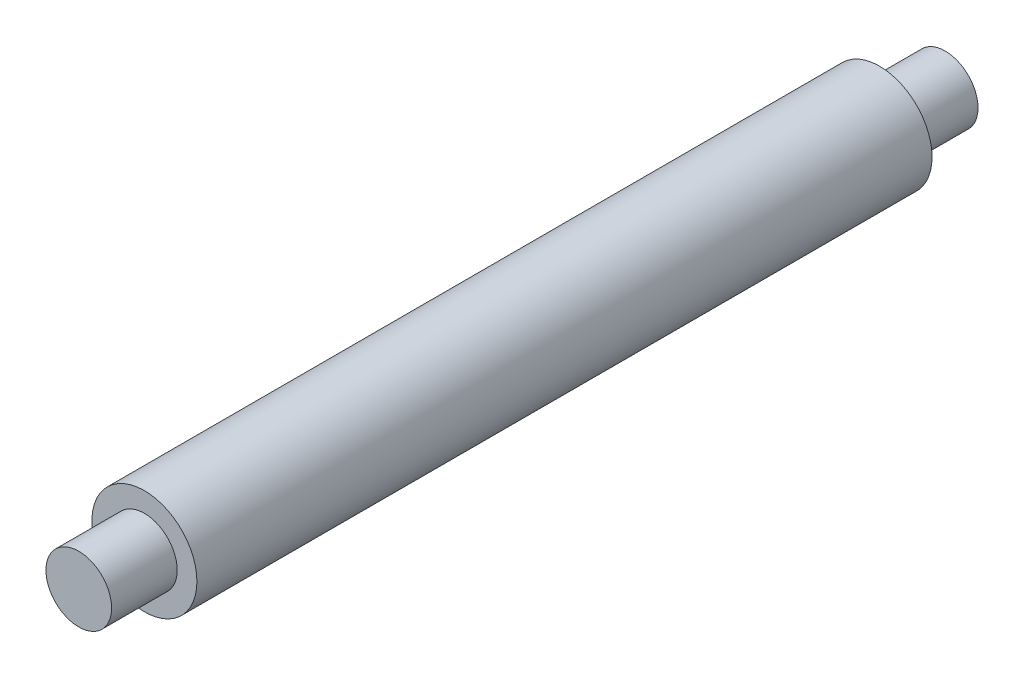
ISO-10303-21;
HEADER;
FILE_DESCRIPTION(('STEP AP214'),'2;1');
FILE_NAME('part.step','',(''),(''),'','','');
FILE_SCHEMA(('AUTOMOTIVE_DESIGN { 1 0 10303 214 1 1 1 1 }'));
ENDSEC;
DATA;
#1=APPLICATION_CONTEXT('core data for automotive mechanical design processes');
#2=APPLICATION_PROTOCOL_DEFINITION('international standard','automotive_design',2000,#1);
#3=PRODUCT_CONTEXT('',#1,'mechanical');
#4=PRODUCT('Part','Part','',(#3));
#5=PRODUCT_RELATED_PRODUCT_CATEGORY('part','',(#4));
#6=PRODUCT_DEFINITION_FORMATION('','',#4);
#7=PRODUCT_DEFINITION_CONTEXT('part definition',#1,'design');
#8=PRODUCT_DEFINITION('design','',#6,#7);
#9=PRODUCT_DEFINITION_SHAPE('','',#8);
#10=(LENGTH_UNIT() NAMED_UNIT(*) SI_UNIT(.MILLI.,.METRE.));
#11=(NAMED_UNIT(*) PLANE_ANGLE_UNIT() SI_UNIT($,.RADIAN.));
#12=(NAMED_UNIT(*) SI_UNIT($,.STERADIAN.) SOLID_ANGLE_UNIT());
#13=UNCERTAINTY_MEASURE_WITH_UNIT(LENGTH_MEASURE(1.E-05),#10,'distance_accuracy_value','');
#14=(GEOMETRIC_REPRESENTATION_CONTEXT(3) GLOBAL_UNCERTAINTY_ASSIGNED_CONTEXT((#13)) GLOBAL_UNIT_ASSIGNED_CONTEXT((#10,
#11,#12)) REPRESENTATION_CONTEXT('',''));
#15=CARTESIAN_POINT('',(0.,0.,0.));
#16=DIRECTION('',(0.,0.,1.));
#17=DIRECTION('',(1.,0.,0.));
#18=AXIS2_PLACEMENT_3D('',#15,#16,#17);
#19=CARTESIAN_POINT('',(0.,0.,56.));
#20=DIRECTION('',(0.,0.,-1.));
#21=DIRECTION('',(-1.,0.,0.));
#22=AXIS2_PLACEMENT_3D('',#19,#20,#21);
#23=CYLINDRICAL_SURFACE('',#22,4.);
#24=CARTESIAN_POINT('',(0.,0.,56.));
#25=DIRECTION('',(0.,0.,1.));
#26=DIRECTION('',(1.,0.,0.));
#27=AXIS2_PLACEMENT_3D('',#24,#25,#26);
#28=CIRCLE('',#27,4.);
#29=CARTESIAN_POINT('',(4.,0.,56.));
#30=VERTEX_POINT('',#29);
#31=EDGE_CURVE('E36',#30,#30,#28,.T.);
#32=ORIENTED_EDGE('',*,*,#31,.F.);
#33=EDGE_LOOP('',(#32));
#34=FACE_BOUND('',#33,.T.);
#35=CARTESIAN_POINT('',(0.,0.,0.));
#36=DIRECTION('',(0.,0.,1.));
#37=DIRECTION('',(1.,0.,0.));
#38=AXIS2_PLACEMENT_3D('',#35,#36,#37);
#39=CIRCLE('',#38,4.);
#40=CARTESIAN_POINT('',(4.,0.,0.));
#41=VERTEX_POINT('',#40);
#42=EDGE_CURVE('E40',#41,#41,#39,.T.);
#43=ORIENTED_EDGE('',*,*,#42,.T.);
#44=EDGE_LOOP('',(#43));
#45=FACE_BOUND('',#44,.T.);
#46=ADVANCED_FACE('F30',(#34,#45),#23,.T.);
#47=CARTESIAN_POINT('',(0.,0.,56.));
#48=DIRECTION('',(0.,0.,1.));
#49=DIRECTION('',(1.,0.,0.));
#50=AXIS2_PLACEMENT_3D('',#47,#48,#49);
#51=PLANE('',#50);
#52=CARTESIAN_POINT('',(0.,0.,56.));
#53=DIRECTION('',(0.,0.,1.));
#54=DIRECTION('',(1.,0.,0.));
#55=AXIS2_PLACEMENT_3D('',#52,#53,#54);
#56=CIRCLE('',#55,2.5);
#57=CARTESIAN_POINT('',(2.5,0.,56.));
#58=VERTEX_POINT('',#57);
#59=EDGE_CURVE('E47',#58,#58,#56,.T.);
#60=ORIENTED_EDGE('',*,*,#59,.F.);
#61=EDGE_LOOP('',(#60));
#62=FACE_BOUND('',#61,.T.);
#63=ORIENTED_EDGE('',*,*,#31,.T.);
#64=EDGE_LOOP('',(#63));
#65=FACE_BOUND('',#64,.T.);
#66=ADVANCED_FACE('F71',(#62,#65),#51,.T.);
#67=CARTESIAN_POINT('',(0.,0.,0.));
#68=DIRECTION('',(0.,0.,1.));
#69=DIRECTION('',(1.,0.,0.));
#70=AXIS2_PLACEMENT_3D('',#67,#68,#69);
#71=PLANE('',#70);
#72=CARTESIAN_POINT('',(0.,0.,0.));
#73=DIRECTION('',(0.,0.,1.));
#74=DIRECTION('',(1.,0.,0.));
#75=AXIS2_PLACEMENT_3D('',#72,#73,#74);
#76=CIRCLE('',#75,2.5);
#77=CARTESIAN_POINT('',(2.5,0.,0.));
#78=VERTEX_POINT('',#77);
#79=EDGE_CURVE('E10',#78,#78,#76,.F.);
#80=ORIENTED_EDGE('',*,*,#79,.F.);
#81=EDGE_LOOP('',(#80));
#82=FACE_BOUND('',#81,.T.);
#83=ORIENTED_EDGE('',*,*,#42,.F.);
#84=EDGE_LOOP('',(#83));
#85=FACE_BOUND('',#84,.T.);
#86=ADVANCED_FACE('F76',(#82,#85),#71,.F.);
#87=CARTESIAN_POINT('',(0.,0.,61.));
#88=DIRECTION('',(0.,0.,-1.));
#89=DIRECTION('',(-1.,0.,0.));
#90=AXIS2_PLACEMENT_3D('',#87,#88,#89);
#91=CYLINDRICAL_SURFACE('',#90,2.5);
#92=CARTESIAN_POINT('',(0.,0.,61.));
#93=DIRECTION('',(0.,0.,1.));
#94=DIRECTION('',(1.,0.,0.));
#95=AXIS2_PLACEMENT_3D('',#92,#93,#94);
#96=CIRCLE('',#95,2.5);
#97=CARTESIAN_POINT('',(2.5,0.,61.));
#98=VERTEX_POINT('',#97);
#99=EDGE_CURVE('E45',#98,#98,#96,.T.);
#100=ORIENTED_EDGE('',*,*,#99,.F.);
#101=EDGE_LOOP('',(#100));
#102=FACE_BOUND('',#101,.T.);
#103=ORIENTED_EDGE('',*,*,#59,.T.);
#104=EDGE_LOOP('',(#103));
#105=FACE_BOUND('',#104,.T.);
#106=ADVANCED_FACE('F67',(#102,#105),#91,.T.);
#107=CARTESIAN_POINT('',(0.,0.,61.));
#108=DIRECTION('',(0.,0.,1.));
#109=DIRECTION('',(1.,0.,0.));
#110=AXIS2_PLACEMENT_3D('',#107,#108,#109);
#111=PLANE('',#110);
#112=ORIENTED_EDGE('',*,*,#99,.T.);
#113=EDGE_LOOP('',(#112));
#114=FACE_BOUND('',#113,.T.);
#115=ADVANCED_FACE('F60',(#114),#111,.T.);
#116=CARTESIAN_POINT('',(0.,0.,-5.));
#117=DIRECTION('',(0.,0.,1.));
#118=DIRECTION('',(1.,0.,0.));
#119=AXIS2_PLACEMENT_3D('',#116,#117,#118);
#120=CYLINDRICAL_SURFACE('',#119,2.5);
#121=CARTESIAN_POINT('',(0.,0.,-5.));
#122=DIRECTION('',(0.,0.,-1.));
#123=DIRECTION('',(-1.,0.,0.));
#124=AXIS2_PLACEMENT_3D('',#121,#122,#123);
#125=CIRCLE('',#124,2.5);
#126=CARTESIAN_POINT('',(-2.5,0.,-5.));
#127=VERTEX_POINT('',#126);
#128=EDGE_CURVE('E50',#127,#127,#125,.T.);
#129=ORIENTED_EDGE('',*,*,#128,.F.);
#130=EDGE_LOOP('',(#129));
#131=FACE_BOUND('',#130,.T.);
#132=ORIENTED_EDGE('',*,*,#79,.T.);
#133=EDGE_LOOP('',(#132));
#134=FACE_BOUND('',#133,.T.);
#135=ADVANCED_FACE('F58',(#131,#134),#120,.T.);
#136=CARTESIAN_POINT('',(0.,0.,-5.));
#137=DIRECTION('',(0.,0.,-1.));
#138=DIRECTION('',(-1.,0.,0.));
#139=AXIS2_PLACEMENT_3D('',#136,#137,#138);
#140=PLANE('',#139);
#141=ORIENTED_EDGE('',*,*,#128,.T.);
#142=EDGE_LOOP('',(#141));
#143=FACE_BOUND('',#142,.T.);
#144=ADVANCED_FACE('F56',(#143),#140,.T.);
#145=CLOSED_SHELL('',(#46,#66,#86,#106,#115,#135,#144));
#146=MANIFOLD_SOLID_BREP('B2',#145);
#147=ADVANCED_BREP_SHAPE_REPRESENTATION('',(#18,#146),#14);
#148=SHAPE_DEFINITION_REPRESENTATION(#9,#147);
ENDSEC;
END-ISO-10303-21;
